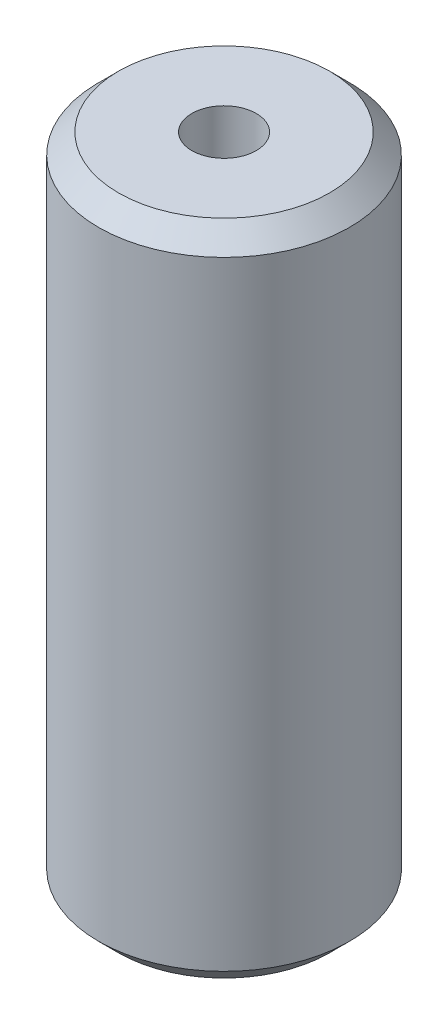
ISO-10303-21;
HEADER;
FILE_DESCRIPTION(('STEP AP214'),'2;1');
FILE_NAME('part.step','',(''),(''),'','','');
FILE_SCHEMA(('AUTOMOTIVE_DESIGN { 1 0 10303 214 1 1 1 1 }'));
ENDSEC;
DATA;
#1=APPLICATION_CONTEXT('core data for automotive mechanical design processes');
#2=APPLICATION_PROTOCOL_DEFINITION('international standard','automotive_design',2000,#1);
#3=PRODUCT_CONTEXT('',#1,'mechanical');
#4=PRODUCT('Part','Part','',(#3));
#5=PRODUCT_RELATED_PRODUCT_CATEGORY('part','',(#4));
#6=PRODUCT_DEFINITION_FORMATION('','',#4);
#7=PRODUCT_DEFINITION_CONTEXT('part definition',#1,'design');
#8=PRODUCT_DEFINITION('design','',#6,#7);
#9=PRODUCT_DEFINITION_SHAPE('','',#8);
#10=(LENGTH_UNIT() NAMED_UNIT(*) SI_UNIT(.MILLI.,.METRE.));
#11=(NAMED_UNIT(*) PLANE_ANGLE_UNIT() SI_UNIT($,.RADIAN.));
#12=(NAMED_UNIT(*) SI_UNIT($,.STERADIAN.) SOLID_ANGLE_UNIT());
#13=UNCERTAINTY_MEASURE_WITH_UNIT(LENGTH_MEASURE(1.E-05),#10,'distance_accuracy_value','');
#14=(GEOMETRIC_REPRESENTATION_CONTEXT(3) GLOBAL_UNCERTAINTY_ASSIGNED_CONTEXT((#13)) GLOBAL_UNIT_ASSIGNED_CONTEXT((#10,
#11,#12)) REPRESENTATION_CONTEXT('',''));
#15=CARTESIAN_POINT('',(0.,0.,0.));
#16=DIRECTION('',(0.,0.,1.));
#17=DIRECTION('',(1.,0.,0.));
#18=AXIS2_PLACEMENT_3D('',#15,#16,#17);
#19=CARTESIAN_POINT('',(0.,26.2350977258085,0.));
#20=DIRECTION('',(0.,-1.,0.));
#21=DIRECTION('',(0.,0.,-1.));
#22=AXIS2_PLACEMENT_3D('',#19,#20,#21);
#23=CYLINDRICAL_SURFACE('',#22,5.);
#24=CARTESIAN_POINT('',(0.,25.4414182289674,0.));
#25=DIRECTION('',(0.,1.,0.));
#26=DIRECTION('',(0.,0.,1.));
#27=AXIS2_PLACEMENT_3D('',#24,#25,#26);
#28=CIRCLE('',#27,5.);
#29=CARTESIAN_POINT('',(0.,25.4414182289674,5.));
#30=VERTEX_POINT('',#29);
#31=EDGE_CURVE('E50',#30,#30,#28,.F.);
#32=ORIENTED_EDGE('',*,*,#31,.T.);
#33=EDGE_LOOP('',(#32));
#34=FACE_BOUND('',#33,.T.);
#35=CARTESIAN_POINT('',(0.,0.79367949684106,0.));
#36=DIRECTION('',(0.,1.,0.));
#37=DIRECTION('',(0.,0.,1.));
#38=AXIS2_PLACEMENT_3D('',#35,#36,#37);
#39=CIRCLE('',#38,5.);
#40=CARTESIAN_POINT('',(0.,0.79367949684106,5.));
#41=VERTEX_POINT('',#40);
#42=EDGE_CURVE('E51',#41,#41,#39,.T.);
#43=ORIENTED_EDGE('',*,*,#42,.T.);
#44=EDGE_LOOP('',(#43));
#45=FACE_BOUND('',#44,.T.);
#46=ADVANCED_FACE('F39',(#34,#45),#23,.T.);
#47=CARTESIAN_POINT('',(0.,26.2350977258085,0.));
#48=DIRECTION('',(0.,1.,0.));
#49=DIRECTION('',(0.,0.,1.));
#50=AXIS2_PLACEMENT_3D('',#47,#48,#49);
#51=PLANE('',#50);
#52=CARTESIAN_POINT('',(0.,26.2350977258085,0.));
#53=DIRECTION('',(0.,1.,0.));
#54=DIRECTION('',(0.,0.,1.));
#55=AXIS2_PLACEMENT_3D('',#52,#53,#54);
#56=CIRCLE('',#55,4.20632050315894);
#57=CARTESIAN_POINT('',(0.,26.2350977258085,4.20632050315894));
#58=VERTEX_POINT('',#57);
#59=EDGE_CURVE('E54',#58,#58,#56,.T.);
#60=ORIENTED_EDGE('',*,*,#59,.T.);
#61=EDGE_LOOP('',(#60));
#62=FACE_BOUND('',#61,.T.);
#63=CARTESIAN_POINT('',(0.,26.2350977258085,0.));
#64=DIRECTION('',(0.,1.,0.));
#65=DIRECTION('',(0.,0.,1.));
#66=AXIS2_PLACEMENT_3D('',#63,#64,#65);
#67=CIRCLE('',#66,1.28415811850318);
#68=CARTESIAN_POINT('',(0.,26.2350977258085,1.28415811850318));
#69=VERTEX_POINT('',#68);
#70=EDGE_CURVE('E58',#69,#69,#67,.T.);
#71=ORIENTED_EDGE('',*,*,#70,.F.);
#72=EDGE_LOOP('',(#71));
#73=FACE_BOUND('',#72,.T.);
#74=ADVANCED_FACE('F69',(#62,#73),#51,.T.);
#75=CARTESIAN_POINT('',(0.,0.,0.));
#76=DIRECTION('',(0.,1.,0.));
#77=DIRECTION('',(0.,0.,1.));
#78=AXIS2_PLACEMENT_3D('',#75,#76,#77);
#79=PLANE('',#78);
#80=CARTESIAN_POINT('',(0.,0.,0.));
#81=DIRECTION('',(0.,1.,0.));
#82=DIRECTION('',(0.,0.,1.));
#83=AXIS2_PLACEMENT_3D('',#80,#81,#82);
#84=CIRCLE('',#83,4.20632050315894);
#85=CARTESIAN_POINT('',(0.,0.,4.20632050315894));
#86=VERTEX_POINT('',#85);
#87=EDGE_CURVE('E10',#86,#86,#84,.F.);
#88=ORIENTED_EDGE('',*,*,#87,.T.);
#89=EDGE_LOOP('',(#88));
#90=FACE_BOUND('',#89,.T.);
#91=CARTESIAN_POINT('',(0.,0.,0.));
#92=DIRECTION('',(0.,1.,0.));
#93=DIRECTION('',(0.,0.,1.));
#94=AXIS2_PLACEMENT_3D('',#91,#92,#93);
#95=CIRCLE('',#94,1.28415811850318);
#96=CARTESIAN_POINT('',(0.,0.,1.28415811850318));
#97=VERTEX_POINT('',#96);
#98=EDGE_CURVE('E63',#97,#97,#95,.T.);
#99=ORIENTED_EDGE('',*,*,#98,.T.);
#100=EDGE_LOOP('',(#99));
#101=FACE_BOUND('',#100,.T.);
#102=ADVANCED_FACE('F75',(#90,#101),#79,.F.);
#103=CARTESIAN_POINT('',(0.,26.2350977258085,0.));
#104=DIRECTION('',(0.,-1.,0.));
#105=DIRECTION('',(0.,0.,-1.));
#106=AXIS2_PLACEMENT_3D('',#103,#104,#105);
#107=CYLINDRICAL_SURFACE('',#106,1.28415811850318);
#108=ORIENTED_EDGE('',*,*,#70,.T.);
#109=EDGE_LOOP('',(#108));
#110=FACE_BOUND('',#109,.T.);
#111=ORIENTED_EDGE('',*,*,#98,.F.);
#112=EDGE_LOOP('',(#111));
#113=FACE_BOUND('',#112,.T.);
#114=ADVANCED_FACE('F70',(#110,#113),#107,.F.);
#115=CARTESIAN_POINT('',(0.,26.2350977258085,0.));
#116=DIRECTION('',(0.,-1.,0.));
#117=DIRECTION('',(0.,0.,-1.));
#118=AXIS2_PLACEMENT_3D('',#115,#116,#117);
#119=CONICAL_SURFACE('',#118,4.20632050315894,0.785398163397448);
#120=ORIENTED_EDGE('',*,*,#31,.F.);
#121=EDGE_LOOP('',(#120));
#122=FACE_BOUND('',#121,.T.);
#123=ORIENTED_EDGE('',*,*,#59,.F.);
#124=EDGE_LOOP('',(#123));
#125=FACE_BOUND('',#124,.T.);
#126=ADVANCED_FACE('F81',(#122,#125),#119,.T.);
#127=CARTESIAN_POINT('',(0.,0.79367949684106,0.));
#128=DIRECTION('',(0.,1.,0.));
#129=DIRECTION('',(0.,0.,1.));
#130=AXIS2_PLACEMENT_3D('',#127,#128,#129);
#131=CONICAL_SURFACE('',#130,5.,0.78539816339745);
#132=CARTESIAN_POINT('',(0.,0.,4.20632050315894));
#133=CARTESIAN_POINT('',(0.,0.00826749475876093,4.2145879979177));
#134=CARTESIAN_POINT('',(0.,0.016534989517522,4.22285549267646));
#135=CARTESIAN_POINT('',(0.,0.0330699790350441,4.23939048219398));
#136=CARTESIAN_POINT('',(0.,0.0413374737938051,4.24765797695274));
#137=CARTESIAN_POINT('',(0.,0.0578724633113272,4.26419296647027));
#138=CARTESIAN_POINT('',(0.,0.0661399580700882,4.27246046122903));
#139=CARTESIAN_POINT('',(0.,0.0826749475876103,4.28899545074655));
#140=CARTESIAN_POINT('',(0.,0.0909424423463713,4.29726294550531));
#141=CARTESIAN_POINT('',(0.,0.107477431863893,4.31379793502283));
#142=CARTESIAN_POINT('',(0.,0.115744926622654,4.32206542978159));
#143=CARTESIAN_POINT('',(0.,0.132279916140177,4.33860041929911));
#144=CARTESIAN_POINT('',(0.,0.140547410898938,4.34686791405788));
#145=CARTESIAN_POINT('',(0.,0.15708240041646,4.3634029035754));
#146=CARTESIAN_POINT('',(0.,0.165349895175221,4.37167039833416));
#147=CARTESIAN_POINT('',(0.,0.181884884692743,4.38820538785168));
#148=CARTESIAN_POINT('',(0.,0.190152379451504,4.39647288261044));
#149=CARTESIAN_POINT('',(0.,0.206687368969026,4.41300787212796));
#150=CARTESIAN_POINT('',(0.,0.214954863727787,4.42127536688673));
#151=CARTESIAN_POINT('',(0.,0.231489853245309,4.43781035640425));
#152=CARTESIAN_POINT('',(0.,0.23975734800407,4.44607785116301));
#153=CARTESIAN_POINT('',(0.,0.256292337521592,4.46261284068053));
#154=CARTESIAN_POINT('',(0.,0.264559832280353,4.47088033543929));
#155=CARTESIAN_POINT('',(0.,0.281094821797875,4.48741532495681));
#156=CARTESIAN_POINT('',(0.,0.289362316556636,4.49568281971557));
#157=CARTESIAN_POINT('',(0.,0.305897306074158,4.5122178092331));
#158=CARTESIAN_POINT('',(0.,0.314164800832919,4.52048530399186));
#159=CARTESIAN_POINT('',(0.,0.330699790350442,4.53702029350938));
#160=CARTESIAN_POINT('',(0.,0.338967285109203,4.54528778826814));
#161=CARTESIAN_POINT('',(0.,0.355502274626725,4.56182277778566));
#162=CARTESIAN_POINT('',(0.,0.363769769385486,4.57009027254442));
#163=CARTESIAN_POINT('',(0.,0.380304758903008,4.58662526206195));
#164=CARTESIAN_POINT('',(0.,0.388572253661769,4.59489275682071));
#165=CARTESIAN_POINT('',(0.,0.405107243179291,4.61142774633823));
#166=CARTESIAN_POINT('',(0.,0.413374737938052,4.61969524109699));
#167=CARTESIAN_POINT('',(0.,0.429909727455574,4.63623023061451));
#168=CARTESIAN_POINT('',(0.,0.438177222214335,4.64449772537327));
#169=CARTESIAN_POINT('',(0.,0.454712211731857,4.6610327148908));
#170=CARTESIAN_POINT('',(0.,0.462979706490618,4.66930020964956));
#171=CARTESIAN_POINT('',(0.,0.47951469600814,4.68583519916708));
#172=CARTESIAN_POINT('',(0.,0.487782190766901,4.69410269392584));
#173=CARTESIAN_POINT('',(0.,0.504317180284424,4.71063768344336));
#174=CARTESIAN_POINT('',(0.,0.512584675043185,4.71890517820212));
#175=CARTESIAN_POINT('',(0.,0.529119664560707,4.73544016771965));
#176=CARTESIAN_POINT('',(0.,0.537387159319468,4.74370766247841));
#177=CARTESIAN_POINT('',(0.,0.55392214883699,4.76024265199593));
#178=CARTESIAN_POINT('',(0.,0.562189643595751,4.76851014675469));
#179=CARTESIAN_POINT('',(0.,0.578724633113273,4.78504513627221));
#180=CARTESIAN_POINT('',(0.,0.586992127872034,4.79331263103097));
#181=CARTESIAN_POINT('',(0.,0.603527117389556,4.8098476205485));
#182=CARTESIAN_POINT('',(0.,0.611794612148317,4.81811511530726));
#183=CARTESIAN_POINT('',(0.,0.628329601665839,4.83465010482478));
#184=CARTESIAN_POINT('',(0.,0.6365970964246,4.84291759958354));
#185=CARTESIAN_POINT('',(0.,0.653132085942122,4.85945258910106));
#186=CARTESIAN_POINT('',(0.,0.661399580700883,4.86772008385982));
#187=CARTESIAN_POINT('',(0.,0.677934570218405,4.88425507337735));
#188=CARTESIAN_POINT('',(0.,0.686202064977166,4.89252256813611));
#189=CARTESIAN_POINT('',(0.,0.702737054494688,4.90905755765363));
#190=CARTESIAN_POINT('',(0.,0.711004549253449,4.91732505241239));
#191=CARTESIAN_POINT('',(0.,0.727539538770972,4.93386004192991));
#192=CARTESIAN_POINT('',(0.,0.735807033529733,4.94212753668867));
#193=CARTESIAN_POINT('',(0.,0.752342023047255,4.95866252620619));
#194=CARTESIAN_POINT('',(0.,0.760609517806016,4.96693002096496));
#195=CARTESIAN_POINT('',(0.,0.777144507323538,4.98346501048248));
#196=CARTESIAN_POINT('',(0.,0.785412002082299,4.99173250524124));
#197=CARTESIAN_POINT('',(0.,0.79367949684106,5.));
#198=B_SPLINE_CURVE_WITH_KNOTS('',3,(#132,#133,#134,#135,#136,#137,#138,#139,#140,#141,#142,
#143,#144,#145,#146,#147,#148,#149,#150,#151,#152,#153,#154,#155,#156,#157,#158,#159,#160,#161,
#162,#163,#164,#165,#166,#167,#168,#169,#170,#171,#172,#173,#174,#175,#176,#177,#178,#179,#180,
#181,#182,#183,#184,#185,#186,#187,#188,#189,#190,#191,#192,#193,#194,#195,#196,#197),
.UNSPECIFIED.,.F.,.F.,(4,2,2,2,2,2,2,2,2,2,2,2,2,2,2,2,2,2,2,2,2,2,2,2,2,2,2,2,2,2,2,2,4),(0.,
0.035076009644065,0.0701520192881301,0.105228028932195,0.14030403857626,0.175380048220325,
0.21045605786439,0.245532067508455,0.28060807715252,0.315684086796585,0.350760096440651,
0.385836106084716,0.420912115728781,0.455988125372846,0.491064135016911,0.526140144660976,
0.561216154305041,0.596292163949106,0.631368173593172,0.666444183237237,0.701520192881302,
0.736596202525367,0.771672212169432,0.806748221813497,0.841824231457562,0.876900241101627,
0.911976250745692,0.947052260389758,0.982128270033823,1.01720427967789,1.05228028932195,
1.08735629896602,1.12243230861008),.UNSPECIFIED.);
#199=EDGE_CURVE('BSEAM45',#86,#41,#198,.T.);
#200=ORIENTED_EDGE('',*,*,#87,.F.);
#201=ORIENTED_EDGE('',*,*,#42,.F.);
#202=ORIENTED_EDGE('',*,*,#199,.T.);
#203=ORIENTED_EDGE('',*,*,#199,.F.);
#204=EDGE_LOOP('',(#200,#202,#201,#203));
#205=FACE_BOUND('',#204,.T.);
#206=ADVANCED_FACE('F45',(#205),#131,.T.);
#207=CLOSED_SHELL('',(#46,#74,#102,#114,#126,#206));
#208=MANIFOLD_SOLID_BREP('B2',#207);
#209=ADVANCED_BREP_SHAPE_REPRESENTATION('',(#18,#208),#14);
#210=SHAPE_DEFINITION_REPRESENTATION(#9,#209);
ENDSEC;
END-ISO-10303-21;
